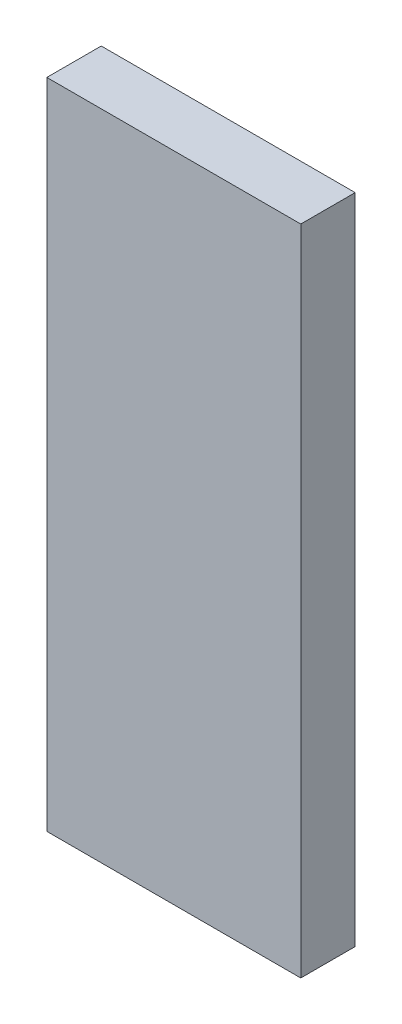
ISO-10303-21;
HEADER;
FILE_DESCRIPTION(('STEP AP214'),'2;1');
FILE_NAME('part.step','',(''),(''),'','','');
FILE_SCHEMA(('AUTOMOTIVE_DESIGN { 1 0 10303 214 1 1 1 1 }'));
ENDSEC;
DATA;
#1=APPLICATION_CONTEXT('core data for automotive mechanical design processes');
#2=APPLICATION_PROTOCOL_DEFINITION('international standard','automotive_design',2000,#1);
#3=PRODUCT_CONTEXT('',#1,'mechanical');
#4=PRODUCT('Part','Part','',(#3));
#5=PRODUCT_RELATED_PRODUCT_CATEGORY('part','',(#4));
#6=PRODUCT_DEFINITION_FORMATION('','',#4);
#7=PRODUCT_DEFINITION_CONTEXT('part definition',#1,'design');
#8=PRODUCT_DEFINITION('design','',#6,#7);
#9=PRODUCT_DEFINITION_SHAPE('','',#8);
#10=(LENGTH_UNIT() NAMED_UNIT(*) SI_UNIT(.MILLI.,.METRE.));
#11=(NAMED_UNIT(*) PLANE_ANGLE_UNIT() SI_UNIT($,.RADIAN.));
#12=(NAMED_UNIT(*) SI_UNIT($,.STERADIAN.) SOLID_ANGLE_UNIT());
#13=UNCERTAINTY_MEASURE_WITH_UNIT(LENGTH_MEASURE(1.E-05),#10,'distance_accuracy_value','');
#14=(GEOMETRIC_REPRESENTATION_CONTEXT(3) GLOBAL_UNCERTAINTY_ASSIGNED_CONTEXT((#13)) GLOBAL_UNIT_ASSIGNED_CONTEXT((#10,
#11,#12)) REPRESENTATION_CONTEXT('',''));
#15=CARTESIAN_POINT('',(0.,0.,0.));
#16=DIRECTION('',(0.,0.,1.));
#17=DIRECTION('',(1.,0.,0.));
#18=AXIS2_PLACEMENT_3D('',#15,#16,#17);
#19=CARTESIAN_POINT('',(0.,1.270000005641E-06,0.1499997));
#20=DIRECTION('',(0.,0.,1.));
#21=DIRECTION('',(1.,0.,0.));
#22=AXIS2_PLACEMENT_3D('',#19,#20,#21);
#23=PLANE('',#22);
#24=DIRECTION('',(0.999999999993417,3.62857872202251E-06,0.));
#25=VECTOR('',#24,1.);
#26=CARTESIAN_POINT('',(-0.3499993,-0.90000074,0.1499997));
#27=LINE('',#26,#25);
#28=CARTESIAN_POINT('',(-0.3499993,-0.90000074,0.1499997));
#29=VERTEX_POINT('',#28);
#30=CARTESIAN_POINT('',(0.3499993,-0.8999982,0.1499997));
#31=VERTEX_POINT('',#30);
#32=EDGE_CURVE('E84',#29,#31,#27,.T.);
#33=ORIENTED_EDGE('',*,*,#32,.T.);
#34=DIRECTION('',(0.,1.,0.));
#35=VECTOR('',#34,1.);
#36=CARTESIAN_POINT('',(0.3499993,-0.8999982,0.1499997));
#37=LINE('',#36,#35);
#38=CARTESIAN_POINT('',(0.3499993,0.90000328,0.1499997));
#39=VERTEX_POINT('',#38);
#40=EDGE_CURVE('E67',#31,#39,#37,.T.);
#41=ORIENTED_EDGE('',*,*,#40,.T.);
#42=DIRECTION('',(-0.999999999993417,-3.62857868141951E-06,0.));
#43=VECTOR('',#42,1.);
#44=CARTESIAN_POINT('',(0.3499993,0.90000328,0.1499997));
#45=LINE('',#44,#43);
#46=CARTESIAN_POINT('',(-0.3499993,0.90000074,0.1499997));
#47=VERTEX_POINT('',#46);
#48=EDGE_CURVE('E102',#39,#47,#45,.T.);
#49=ORIENTED_EDGE('',*,*,#48,.T.);
#50=DIRECTION('',(0.,-1.,0.));
#51=VECTOR('',#50,1.);
#52=CARTESIAN_POINT('',(-0.3499993,0.90000074,0.1499997));
#53=LINE('',#52,#51);
#54=EDGE_CURVE('E11',#47,#29,#53,.T.);
#55=ORIENTED_EDGE('',*,*,#54,.T.);
#56=EDGE_LOOP('',(#33,#41,#49,#55));
#57=FACE_BOUND('',#56,.T.);
#58=ADVANCED_FACE('F16',(#57),#23,.T.);
#59=CARTESIAN_POINT('',(0.,1.270000005641E-06,0.));
#60=DIRECTION('',(0.,0.,1.));
#61=DIRECTION('',(1.,0.,0.));
#62=AXIS2_PLACEMENT_3D('',#59,#60,#61);
#63=PLANE('',#62);
#64=DIRECTION('',(0.999999999993417,3.62857872202251E-06,0.));
#65=VECTOR('',#64,1.);
#66=CARTESIAN_POINT('',(-0.3499993,-0.90000074,0.));
#67=LINE('',#66,#65);
#68=CARTESIAN_POINT('',(-0.3499993,-0.90000074,0.));
#69=VERTEX_POINT('',#68);
#70=CARTESIAN_POINT('',(0.3499993,-0.8999982,0.));
#71=VERTEX_POINT('',#70);
#72=EDGE_CURVE('E78',#69,#71,#67,.T.);
#73=ORIENTED_EDGE('',*,*,#72,.F.);
#74=DIRECTION('',(0.,-1.,0.));
#75=VECTOR('',#74,1.);
#76=CARTESIAN_POINT('',(-0.3499993,0.90000074,0.));
#77=LINE('',#76,#75);
#78=CARTESIAN_POINT('',(-0.3499993,0.90000074,0.));
#79=VERTEX_POINT('',#78);
#80=EDGE_CURVE('E27',#79,#69,#77,.T.);
#81=ORIENTED_EDGE('',*,*,#80,.F.);
#82=DIRECTION('',(-0.999999999993417,-3.62857868141951E-06,0.));
#83=VECTOR('',#82,1.);
#84=CARTESIAN_POINT('',(0.3499993,0.90000328,0.));
#85=LINE('',#84,#83);
#86=CARTESIAN_POINT('',(0.3499993,0.90000328,0.));
#87=VERTEX_POINT('',#86);
#88=EDGE_CURVE('E20',#87,#79,#85,.T.);
#89=ORIENTED_EDGE('',*,*,#88,.F.);
#90=DIRECTION('',(0.,1.,0.));
#91=VECTOR('',#90,1.);
#92=CARTESIAN_POINT('',(0.3499993,-0.8999982,0.));
#93=LINE('',#92,#91);
#94=EDGE_CURVE('E75',#71,#87,#93,.T.);
#95=ORIENTED_EDGE('',*,*,#94,.F.);
#96=EDGE_LOOP('',(#73,#81,#89,#95));
#97=FACE_BOUND('',#96,.T.);
#98=ADVANCED_FACE('F76',(#97),#63,.F.);
#99=CARTESIAN_POINT('',(-0.3499993,0.90000074,0.));
#100=DIRECTION('',(1.,0.,0.));
#101=DIRECTION('',(0.,1.,0.));
#102=AXIS2_PLACEMENT_3D('',#99,#100,#101);
#103=PLANE('',#102);
#104=DIRECTION('',(0.,0.,1.));
#105=VECTOR('',#104,1.);
#106=CARTESIAN_POINT('',(-0.3499993,0.90000074,0.));
#107=LINE('',#106,#105);
#108=EDGE_CURVE('E105',#79,#47,#107,.T.);
#109=ORIENTED_EDGE('',*,*,#108,.F.);
#110=ORIENTED_EDGE('',*,*,#80,.T.);
#111=DIRECTION('',(0.,0.,1.));
#112=VECTOR('',#111,1.);
#113=CARTESIAN_POINT('',(-0.3499993,-0.90000074,0.));
#114=LINE('',#113,#112);
#115=EDGE_CURVE('E94',#69,#29,#114,.T.);
#116=ORIENTED_EDGE('',*,*,#115,.T.);
#117=ORIENTED_EDGE('',*,*,#54,.F.);
#118=EDGE_LOOP('',(#109,#110,#116,#117));
#119=FACE_BOUND('',#118,.T.);
#120=ADVANCED_FACE('F118',(#119),#103,.F.);
#121=CARTESIAN_POINT('',(0.3499993,0.90000328,0.));
#122=DIRECTION('',(3.62857868141951E-06,-0.999999999993417,0.));
#123=DIRECTION('',(0.,0.,-1.));
#124=AXIS2_PLACEMENT_3D('',#121,#122,#123);
#125=PLANE('',#124);
#126=DIRECTION('',(0.,0.,1.));
#127=VECTOR('',#126,1.);
#128=CARTESIAN_POINT('',(0.3499993,0.90000328,0.));
#129=LINE('',#128,#127);
#130=EDGE_CURVE('E83',#87,#39,#129,.T.);
#131=ORIENTED_EDGE('',*,*,#130,.F.);
#132=ORIENTED_EDGE('',*,*,#88,.T.);
#133=ORIENTED_EDGE('',*,*,#108,.T.);
#134=ORIENTED_EDGE('',*,*,#48,.F.);
#135=EDGE_LOOP('',(#131,#132,#133,#134));
#136=FACE_BOUND('',#135,.T.);
#137=ADVANCED_FACE('F18',(#136),#125,.F.);
#138=CARTESIAN_POINT('',(0.3499993,-0.8999982,0.));
#139=DIRECTION('',(-1.,0.,0.));
#140=DIRECTION('',(0.,0.,1.));
#141=AXIS2_PLACEMENT_3D('',#138,#139,#140);
#142=PLANE('',#141);
#143=DIRECTION('',(0.,0.,1.));
#144=VECTOR('',#143,1.);
#145=CARTESIAN_POINT('',(0.3499993,-0.8999982,0.));
#146=LINE('',#145,#144);
#147=EDGE_CURVE('E87',#71,#31,#146,.T.);
#148=ORIENTED_EDGE('',*,*,#147,.F.);
#149=ORIENTED_EDGE('',*,*,#94,.T.);
#150=ORIENTED_EDGE('',*,*,#130,.T.);
#151=ORIENTED_EDGE('',*,*,#40,.F.);
#152=EDGE_LOOP('',(#148,#149,#150,#151));
#153=FACE_BOUND('',#152,.T.);
#154=ADVANCED_FACE('F88',(#153),#142,.F.);
#155=CARTESIAN_POINT('',(-0.3499993,-0.90000074,0.));
#156=DIRECTION('',(-3.62857872202251E-06,0.999999999993417,0.));
#157=DIRECTION('',(0.,0.,1.));
#158=AXIS2_PLACEMENT_3D('',#155,#156,#157);
#159=PLANE('',#158);
#160=ORIENTED_EDGE('',*,*,#115,.F.);
#161=ORIENTED_EDGE('',*,*,#72,.T.);
#162=ORIENTED_EDGE('',*,*,#147,.T.);
#163=ORIENTED_EDGE('',*,*,#32,.F.);
#164=EDGE_LOOP('',(#160,#161,#162,#163));
#165=FACE_BOUND('',#164,.T.);
#166=ADVANCED_FACE('F93',(#165),#159,.F.);
#167=CLOSED_SHELL('',(#58,#98,#120,#137,#154,#166));
#168=MANIFOLD_SOLID_BREP('B1',#167);
#169=ADVANCED_BREP_SHAPE_REPRESENTATION('',(#18,#168),#14);
#170=SHAPE_DEFINITION_REPRESENTATION(#9,#169);
ENDSEC;
END-ISO-10303-21;
